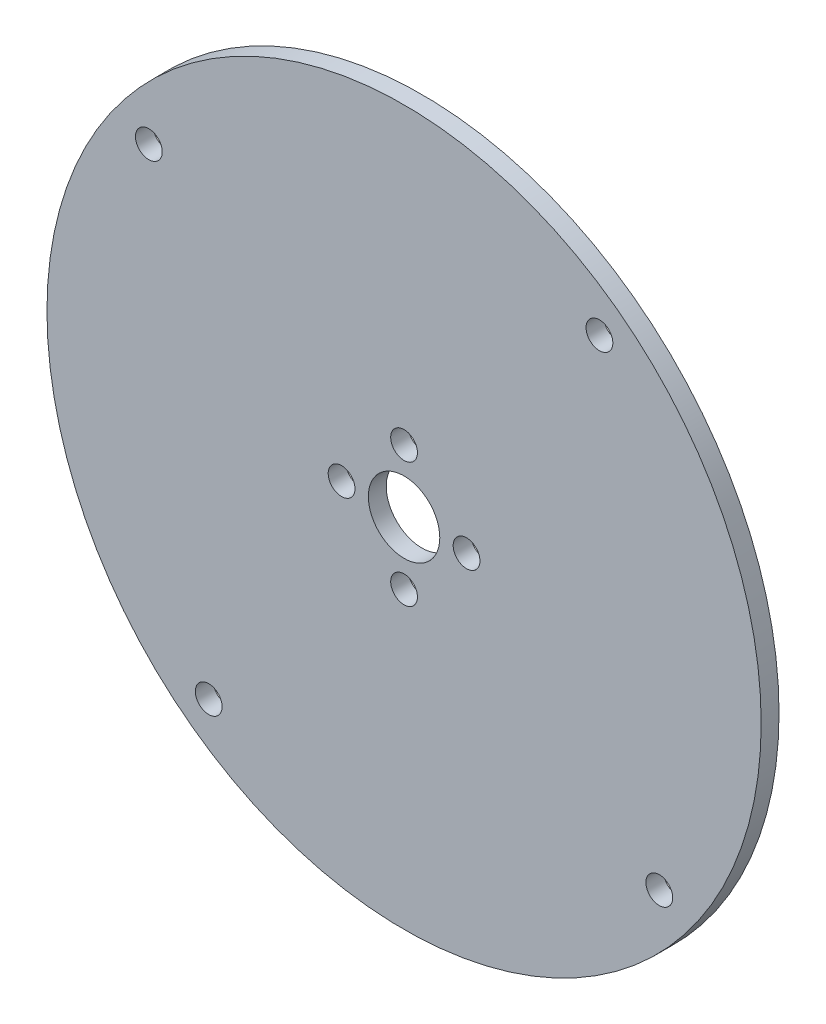
ISO-10303-21;
HEADER;
FILE_DESCRIPTION(('STEP AP214'),'2;1');
FILE_NAME('part.step','',(''),(''),'','','');
FILE_SCHEMA(('AUTOMOTIVE_DESIGN { 1 0 10303 214 1 1 1 1 }'));
ENDSEC;
DATA;
#1=APPLICATION_CONTEXT('core data for automotive mechanical design processes');
#2=APPLICATION_PROTOCOL_DEFINITION('international standard','automotive_design',2000,#1);
#3=PRODUCT_CONTEXT('',#1,'mechanical');
#4=PRODUCT('Part','Part','',(#3));
#5=PRODUCT_RELATED_PRODUCT_CATEGORY('part','',(#4));
#6=PRODUCT_DEFINITION_FORMATION('','',#4);
#7=PRODUCT_DEFINITION_CONTEXT('part definition',#1,'design');
#8=PRODUCT_DEFINITION('design','',#6,#7);
#9=PRODUCT_DEFINITION_SHAPE('','',#8);
#10=(LENGTH_UNIT() NAMED_UNIT(*) SI_UNIT(.MILLI.,.METRE.));
#11=(NAMED_UNIT(*) PLANE_ANGLE_UNIT() SI_UNIT($,.RADIAN.));
#12=(NAMED_UNIT(*) SI_UNIT($,.STERADIAN.) SOLID_ANGLE_UNIT());
#13=UNCERTAINTY_MEASURE_WITH_UNIT(LENGTH_MEASURE(1.E-05),#10,'distance_accuracy_value','');
#14=(GEOMETRIC_REPRESENTATION_CONTEXT(3) GLOBAL_UNCERTAINTY_ASSIGNED_CONTEXT((#13)) GLOBAL_UNIT_ASSIGNED_CONTEXT((#10,
#11,#12)) REPRESENTATION_CONTEXT('',''));
#15=CARTESIAN_POINT('',(0.,0.,0.));
#16=DIRECTION('',(0.,0.,1.));
#17=DIRECTION('',(1.,0.,0.));
#18=AXIS2_PLACEMENT_3D('',#15,#16,#17);
#19=CARTESIAN_POINT('',(0.,0.,2.));
#20=DIRECTION('',(0.,0.,1.));
#21=DIRECTION('',(1.,0.,0.));
#22=AXIS2_PLACEMENT_3D('',#19,#20,#21);
#23=PLANE('',#22);
#24=CARTESIAN_POINT('',(-21.8824049027506,-28.5860167856957,2.));
#25=DIRECTION('',(0.,0.,1.));
#26=DIRECTION('',(1.,0.,0.));
#27=AXIS2_PLACEMENT_3D('',#24,#25,#26);
#28=CIRCLE('',#27,1.5);
#29=CARTESIAN_POINT('',(-20.3824049027506,-28.5860167856957,2.));
#30=VERTEX_POINT('',#29);
#31=EDGE_CURVE('E84',#30,#30,#28,.T.);
#32=ORIENTED_EDGE('',*,*,#31,.F.);
#33=EDGE_LOOP('',(#32));
#34=FACE_BOUND('',#33,.T.);
#35=CARTESIAN_POINT('',(-28.5860167856957,21.8824049027506,2.));
#36=DIRECTION('',(0.,0.,1.));
#37=DIRECTION('',(1.,0.,0.));
#38=AXIS2_PLACEMENT_3D('',#35,#36,#37);
#39=CIRCLE('',#38,1.5);
#40=CARTESIAN_POINT('',(-27.0860167856957,21.8824049027506,2.));
#41=VERTEX_POINT('',#40);
#42=EDGE_CURVE('E72',#41,#41,#39,.T.);
#43=ORIENTED_EDGE('',*,*,#42,.F.);
#44=EDGE_LOOP('',(#43));
#45=FACE_BOUND('',#44,.T.);
#46=CARTESIAN_POINT('',(-7.,0.,2.));
#47=DIRECTION('',(0.,0.,1.));
#48=DIRECTION('',(1.,0.,0.));
#49=AXIS2_PLACEMENT_3D('',#46,#47,#48);
#50=CIRCLE('',#49,1.5);
#51=CARTESIAN_POINT('',(-5.5,0.,2.));
#52=VERTEX_POINT('',#51);
#53=EDGE_CURVE('E60',#52,#52,#50,.T.);
#54=ORIENTED_EDGE('',*,*,#53,.F.);
#55=EDGE_LOOP('',(#54));
#56=FACE_BOUND('',#55,.T.);
#57=CARTESIAN_POINT('',(0.,7.,2.));
#58=DIRECTION('',(0.,0.,1.));
#59=DIRECTION('',(1.,0.,0.));
#60=AXIS2_PLACEMENT_3D('',#57,#58,#59);
#61=CIRCLE('',#60,1.5);
#62=CARTESIAN_POINT('',(1.5,7.,2.));
#63=VERTEX_POINT('',#62);
#64=EDGE_CURVE('E48',#63,#63,#61,.T.);
#65=ORIENTED_EDGE('',*,*,#64,.F.);
#66=EDGE_LOOP('',(#65));
#67=FACE_BOUND('',#66,.T.);
#68=CARTESIAN_POINT('',(0.,0.,2.));
#69=DIRECTION('',(0.,0.,1.));
#70=DIRECTION('',(1.,0.,0.));
#71=AXIS2_PLACEMENT_3D('',#68,#69,#70);
#72=CIRCLE('',#71,40.);
#73=CARTESIAN_POINT('',(40.,0.,2.));
#74=VERTEX_POINT('',#73);
#75=EDGE_CURVE('E10',#74,#74,#72,.T.);
#76=ORIENTED_EDGE('',*,*,#75,.T.);
#77=EDGE_LOOP('',(#76));
#78=FACE_BOUND('',#77,.T.);
#79=CARTESIAN_POINT('',(0.,0.,2.));
#80=DIRECTION('',(0.,0.,1.));
#81=DIRECTION('',(1.,0.,0.));
#82=AXIS2_PLACEMENT_3D('',#79,#80,#81);
#83=CIRCLE('',#82,4.);
#84=CARTESIAN_POINT('',(4.,0.,2.));
#85=VERTEX_POINT('',#84);
#86=EDGE_CURVE('E43',#85,#85,#83,.T.);
#87=ORIENTED_EDGE('',*,*,#86,.F.);
#88=EDGE_LOOP('',(#87));
#89=FACE_BOUND('',#88,.T.);
#90=CARTESIAN_POINT('',(0.,-7.,2.));
#91=DIRECTION('',(0.,0.,1.));
#92=DIRECTION('',(1.,0.,0.));
#93=AXIS2_PLACEMENT_3D('',#90,#91,#92);
#94=CIRCLE('',#93,1.5);
#95=CARTESIAN_POINT('',(1.5,-7.,2.));
#96=VERTEX_POINT('',#95);
#97=EDGE_CURVE('E54',#96,#96,#94,.T.);
#98=ORIENTED_EDGE('',*,*,#97,.F.);
#99=EDGE_LOOP('',(#98));
#100=FACE_BOUND('',#99,.T.);
#101=CARTESIAN_POINT('',(7.,0.,2.));
#102=DIRECTION('',(0.,0.,1.));
#103=DIRECTION('',(1.,0.,0.));
#104=AXIS2_PLACEMENT_3D('',#101,#102,#103);
#105=CIRCLE('',#104,1.5);
#106=CARTESIAN_POINT('',(8.5,0.,2.));
#107=VERTEX_POINT('',#106);
#108=EDGE_CURVE('E66',#107,#107,#105,.T.);
#109=ORIENTED_EDGE('',*,*,#108,.F.);
#110=EDGE_LOOP('',(#109));
#111=FACE_BOUND('',#110,.T.);
#112=CARTESIAN_POINT('',(21.8824049027506,28.5860167856957,2.));
#113=DIRECTION('',(0.,0.,1.));
#114=DIRECTION('',(1.,0.,0.));
#115=AXIS2_PLACEMENT_3D('',#112,#113,#114);
#116=CIRCLE('',#115,1.5);
#117=CARTESIAN_POINT('',(23.3824049027506,28.5860167856957,2.));
#118=VERTEX_POINT('',#117);
#119=EDGE_CURVE('E78',#118,#118,#116,.T.);
#120=ORIENTED_EDGE('',*,*,#119,.F.);
#121=EDGE_LOOP('',(#120));
#122=FACE_BOUND('',#121,.T.);
#123=CARTESIAN_POINT('',(28.5860167856957,-21.8824049027506,2.));
#124=DIRECTION('',(0.,0.,1.));
#125=DIRECTION('',(1.,0.,0.));
#126=AXIS2_PLACEMENT_3D('',#123,#124,#125);
#127=CIRCLE('',#126,1.5);
#128=CARTESIAN_POINT('',(30.0860167856957,-21.8824049027506,2.));
#129=VERTEX_POINT('',#128);
#130=EDGE_CURVE('E90',#129,#129,#127,.T.);
#131=ORIENTED_EDGE('',*,*,#130,.F.);
#132=EDGE_LOOP('',(#131));
#133=FACE_BOUND('',#132,.T.);
#134=ADVANCED_FACE('F32',(#34,#45,#56,#67,#78,#89,#100,#111,#122,#133),#23,.T.);
#135=CARTESIAN_POINT('',(0.,0.,0.));
#136=DIRECTION('',(0.,0.,1.));
#137=DIRECTION('',(1.,0.,0.));
#138=AXIS2_PLACEMENT_3D('',#135,#136,#137);
#139=PLANE('',#138);
#140=CARTESIAN_POINT('',(0.,0.,0.));
#141=DIRECTION('',(0.,0.,1.));
#142=DIRECTION('',(1.,0.,0.));
#143=AXIS2_PLACEMENT_3D('',#140,#141,#142);
#144=CIRCLE('',#143,40.);
#145=CARTESIAN_POINT('',(40.,0.,0.));
#146=VERTEX_POINT('',#145);
#147=EDGE_CURVE('E36',#146,#146,#144,.T.);
#148=ORIENTED_EDGE('',*,*,#147,.F.);
#149=EDGE_LOOP('',(#148));
#150=FACE_BOUND('',#149,.T.);
#151=CARTESIAN_POINT('',(0.,0.,0.));
#152=DIRECTION('',(0.,0.,1.));
#153=DIRECTION('',(1.,0.,0.));
#154=AXIS2_PLACEMENT_3D('',#151,#152,#153);
#155=CIRCLE('',#154,4.);
#156=CARTESIAN_POINT('',(4.,0.,0.));
#157=VERTEX_POINT('',#156);
#158=EDGE_CURVE('E45',#157,#157,#155,.T.);
#159=ORIENTED_EDGE('',*,*,#158,.T.);
#160=EDGE_LOOP('',(#159));
#161=FACE_BOUND('',#160,.T.);
#162=CARTESIAN_POINT('',(0.,7.,0.));
#163=DIRECTION('',(0.,0.,1.));
#164=DIRECTION('',(1.,0.,0.));
#165=AXIS2_PLACEMENT_3D('',#162,#163,#164);
#166=CIRCLE('',#165,1.5);
#167=CARTESIAN_POINT('',(1.5,7.,0.));
#168=VERTEX_POINT('',#167);
#169=EDGE_CURVE('E51',#168,#168,#166,.T.);
#170=ORIENTED_EDGE('',*,*,#169,.T.);
#171=EDGE_LOOP('',(#170));
#172=FACE_BOUND('',#171,.T.);
#173=CARTESIAN_POINT('',(0.,-7.,0.));
#174=DIRECTION('',(0.,0.,1.));
#175=DIRECTION('',(1.,0.,0.));
#176=AXIS2_PLACEMENT_3D('',#173,#174,#175);
#177=CIRCLE('',#176,1.5);
#178=CARTESIAN_POINT('',(1.5,-7.,0.));
#179=VERTEX_POINT('',#178);
#180=EDGE_CURVE('E57',#179,#179,#177,.T.);
#181=ORIENTED_EDGE('',*,*,#180,.T.);
#182=EDGE_LOOP('',(#181));
#183=FACE_BOUND('',#182,.T.);
#184=CARTESIAN_POINT('',(-7.,0.,0.));
#185=DIRECTION('',(0.,0.,1.));
#186=DIRECTION('',(1.,0.,0.));
#187=AXIS2_PLACEMENT_3D('',#184,#185,#186);
#188=CIRCLE('',#187,1.5);
#189=CARTESIAN_POINT('',(-5.5,0.,0.));
#190=VERTEX_POINT('',#189);
#191=EDGE_CURVE('E63',#190,#190,#188,.T.);
#192=ORIENTED_EDGE('',*,*,#191,.T.);
#193=EDGE_LOOP('',(#192));
#194=FACE_BOUND('',#193,.T.);
#195=CARTESIAN_POINT('',(7.,0.,0.));
#196=DIRECTION('',(0.,0.,1.));
#197=DIRECTION('',(1.,0.,0.));
#198=AXIS2_PLACEMENT_3D('',#195,#196,#197);
#199=CIRCLE('',#198,1.5);
#200=CARTESIAN_POINT('',(8.5,0.,0.));
#201=VERTEX_POINT('',#200);
#202=EDGE_CURVE('E69',#201,#201,#199,.T.);
#203=ORIENTED_EDGE('',*,*,#202,.T.);
#204=EDGE_LOOP('',(#203));
#205=FACE_BOUND('',#204,.T.);
#206=CARTESIAN_POINT('',(-28.5860167856957,21.8824049027506,0.));
#207=DIRECTION('',(0.,0.,1.));
#208=DIRECTION('',(1.,0.,0.));
#209=AXIS2_PLACEMENT_3D('',#206,#207,#208);
#210=CIRCLE('',#209,1.5);
#211=CARTESIAN_POINT('',(-27.0860167856957,21.8824049027506,0.));
#212=VERTEX_POINT('',#211);
#213=EDGE_CURVE('E75',#212,#212,#210,.T.);
#214=ORIENTED_EDGE('',*,*,#213,.T.);
#215=EDGE_LOOP('',(#214));
#216=FACE_BOUND('',#215,.T.);
#217=CARTESIAN_POINT('',(21.8824049027506,28.5860167856957,0.));
#218=DIRECTION('',(0.,0.,1.));
#219=DIRECTION('',(1.,0.,0.));
#220=AXIS2_PLACEMENT_3D('',#217,#218,#219);
#221=CIRCLE('',#220,1.5);
#222=CARTESIAN_POINT('',(23.3824049027506,28.5860167856957,0.));
#223=VERTEX_POINT('',#222);
#224=EDGE_CURVE('E81',#223,#223,#221,.T.);
#225=ORIENTED_EDGE('',*,*,#224,.T.);
#226=EDGE_LOOP('',(#225));
#227=FACE_BOUND('',#226,.T.);
#228=CARTESIAN_POINT('',(-21.8824049027506,-28.5860167856957,0.));
#229=DIRECTION('',(0.,0.,1.));
#230=DIRECTION('',(1.,0.,0.));
#231=AXIS2_PLACEMENT_3D('',#228,#229,#230);
#232=CIRCLE('',#231,1.5);
#233=CARTESIAN_POINT('',(-20.3824049027506,-28.5860167856957,0.));
#234=VERTEX_POINT('',#233);
#235=EDGE_CURVE('E87',#234,#234,#232,.T.);
#236=ORIENTED_EDGE('',*,*,#235,.T.);
#237=EDGE_LOOP('',(#236));
#238=FACE_BOUND('',#237,.T.);
#239=CARTESIAN_POINT('',(28.5860167856957,-21.8824049027506,0.));
#240=DIRECTION('',(0.,0.,1.));
#241=DIRECTION('',(1.,0.,0.));
#242=AXIS2_PLACEMENT_3D('',#239,#240,#241);
#243=CIRCLE('',#242,1.5);
#244=CARTESIAN_POINT('',(30.0860167856957,-21.8824049027506,0.));
#245=VERTEX_POINT('',#244);
#246=EDGE_CURVE('E93',#245,#245,#243,.T.);
#247=ORIENTED_EDGE('',*,*,#246,.T.);
#248=EDGE_LOOP('',(#247));
#249=FACE_BOUND('',#248,.T.);
#250=ADVANCED_FACE('F103',(#150,#161,#172,#183,#194,#205,#216,#227,#238,#249),#139,.F.);
#251=CARTESIAN_POINT('',(0.,0.,2.));
#252=DIRECTION('',(0.,0.,-1.));
#253=DIRECTION('',(-1.,0.,0.));
#254=AXIS2_PLACEMENT_3D('',#251,#252,#253);
#255=CYLINDRICAL_SURFACE('',#254,40.);
#256=ORIENTED_EDGE('',*,*,#75,.F.);
#257=EDGE_LOOP('',(#256));
#258=FACE_BOUND('',#257,.T.);
#259=ORIENTED_EDGE('',*,*,#147,.T.);
#260=EDGE_LOOP('',(#259));
#261=FACE_BOUND('',#260,.T.);
#262=ADVANCED_FACE('F34',(#258,#261),#255,.T.);
#263=CARTESIAN_POINT('',(0.,0.,2.));
#264=DIRECTION('',(0.,0.,-1.));
#265=DIRECTION('',(-1.,0.,0.));
#266=AXIS2_PLACEMENT_3D('',#263,#264,#265);
#267=CYLINDRICAL_SURFACE('',#266,4.);
#268=ORIENTED_EDGE('',*,*,#86,.T.);
#269=EDGE_LOOP('',(#268));
#270=FACE_BOUND('',#269,.T.);
#271=ORIENTED_EDGE('',*,*,#158,.F.);
#272=EDGE_LOOP('',(#271));
#273=FACE_BOUND('',#272,.T.);
#274=ADVANCED_FACE('F113',(#270,#273),#267,.F.);
#275=CARTESIAN_POINT('',(0.,7.,2.));
#276=DIRECTION('',(0.,0.,-1.));
#277=DIRECTION('',(-1.,0.,0.));
#278=AXIS2_PLACEMENT_3D('',#275,#276,#277);
#279=CYLINDRICAL_SURFACE('',#278,1.5);
#280=ORIENTED_EDGE('',*,*,#64,.T.);
#281=EDGE_LOOP('',(#280));
#282=FACE_BOUND('',#281,.T.);
#283=ORIENTED_EDGE('',*,*,#169,.F.);
#284=EDGE_LOOP('',(#283));
#285=FACE_BOUND('',#284,.T.);
#286=ADVANCED_FACE('F116',(#282,#285),#279,.F.);
#287=CARTESIAN_POINT('',(0.,-7.,2.));
#288=DIRECTION('',(0.,0.,-1.));
#289=DIRECTION('',(-1.,0.,0.));
#290=AXIS2_PLACEMENT_3D('',#287,#288,#289);
#291=CYLINDRICAL_SURFACE('',#290,1.5);
#292=ORIENTED_EDGE('',*,*,#97,.T.);
#293=EDGE_LOOP('',(#292));
#294=FACE_BOUND('',#293,.T.);
#295=ORIENTED_EDGE('',*,*,#180,.F.);
#296=EDGE_LOOP('',(#295));
#297=FACE_BOUND('',#296,.T.);
#298=ADVANCED_FACE('F120',(#294,#297),#291,.F.);
#299=CARTESIAN_POINT('',(-7.,0.,2.));
#300=DIRECTION('',(0.,0.,-1.));
#301=DIRECTION('',(-1.,0.,0.));
#302=AXIS2_PLACEMENT_3D('',#299,#300,#301);
#303=CYLINDRICAL_SURFACE('',#302,1.5);
#304=ORIENTED_EDGE('',*,*,#53,.T.);
#305=EDGE_LOOP('',(#304));
#306=FACE_BOUND('',#305,.T.);
#307=ORIENTED_EDGE('',*,*,#191,.F.);
#308=EDGE_LOOP('',(#307));
#309=FACE_BOUND('',#308,.T.);
#310=ADVANCED_FACE('F124',(#306,#309),#303,.F.);
#311=CARTESIAN_POINT('',(7.,0.,2.));
#312=DIRECTION('',(0.,0.,-1.));
#313=DIRECTION('',(-1.,0.,0.));
#314=AXIS2_PLACEMENT_3D('',#311,#312,#313);
#315=CYLINDRICAL_SURFACE('',#314,1.5);
#316=ORIENTED_EDGE('',*,*,#108,.T.);
#317=EDGE_LOOP('',(#316));
#318=FACE_BOUND('',#317,.T.);
#319=ORIENTED_EDGE('',*,*,#202,.F.);
#320=EDGE_LOOP('',(#319));
#321=FACE_BOUND('',#320,.T.);
#322=ADVANCED_FACE('F128',(#318,#321),#315,.F.);
#323=CARTESIAN_POINT('',(-28.5860167856957,21.8824049027506,2.));
#324=DIRECTION('',(0.,0.,-1.));
#325=DIRECTION('',(-1.,0.,0.));
#326=AXIS2_PLACEMENT_3D('',#323,#324,#325);
#327=CYLINDRICAL_SURFACE('',#326,1.5);
#328=ORIENTED_EDGE('',*,*,#42,.T.);
#329=EDGE_LOOP('',(#328));
#330=FACE_BOUND('',#329,.T.);
#331=ORIENTED_EDGE('',*,*,#213,.F.);
#332=EDGE_LOOP('',(#331));
#333=FACE_BOUND('',#332,.T.);
#334=ADVANCED_FACE('F132',(#330,#333),#327,.F.);
#335=CARTESIAN_POINT('',(21.8824049027506,28.5860167856957,2.));
#336=DIRECTION('',(0.,0.,-1.));
#337=DIRECTION('',(-1.,0.,0.));
#338=AXIS2_PLACEMENT_3D('',#335,#336,#337);
#339=CYLINDRICAL_SURFACE('',#338,1.5);
#340=ORIENTED_EDGE('',*,*,#119,.T.);
#341=EDGE_LOOP('',(#340));
#342=FACE_BOUND('',#341,.T.);
#343=ORIENTED_EDGE('',*,*,#224,.F.);
#344=EDGE_LOOP('',(#343));
#345=FACE_BOUND('',#344,.T.);
#346=ADVANCED_FACE('F136',(#342,#345),#339,.F.);
#347=CARTESIAN_POINT('',(-21.8824049027506,-28.5860167856957,2.));
#348=DIRECTION('',(0.,0.,-1.));
#349=DIRECTION('',(-1.,0.,0.));
#350=AXIS2_PLACEMENT_3D('',#347,#348,#349);
#351=CYLINDRICAL_SURFACE('',#350,1.5);
#352=ORIENTED_EDGE('',*,*,#31,.T.);
#353=EDGE_LOOP('',(#352));
#354=FACE_BOUND('',#353,.T.);
#355=ORIENTED_EDGE('',*,*,#235,.F.);
#356=EDGE_LOOP('',(#355));
#357=FACE_BOUND('',#356,.T.);
#358=ADVANCED_FACE('F140',(#354,#357),#351,.F.);
#359=CARTESIAN_POINT('',(28.5860167856957,-21.8824049027506,2.));
#360=DIRECTION('',(0.,0.,-1.));
#361=DIRECTION('',(-1.,0.,0.));
#362=AXIS2_PLACEMENT_3D('',#359,#360,#361);
#363=CYLINDRICAL_SURFACE('',#362,1.5);
#364=ORIENTED_EDGE('',*,*,#130,.T.);
#365=EDGE_LOOP('',(#364));
#366=FACE_BOUND('',#365,.T.);
#367=ORIENTED_EDGE('',*,*,#246,.F.);
#368=EDGE_LOOP('',(#367));
#369=FACE_BOUND('',#368,.T.);
#370=ADVANCED_FACE('F99',(#366,#369),#363,.F.);
#371=CLOSED_SHELL('',(#134,#250,#262,#274,#286,#298,#310,#322,#334,#346,#358,#370));
#372=MANIFOLD_SOLID_BREP('B2',#371);
#373=ADVANCED_BREP_SHAPE_REPRESENTATION('',(#18,#372),#14);
#374=SHAPE_DEFINITION_REPRESENTATION(#9,#373);
ENDSEC;
END-ISO-10303-21;
